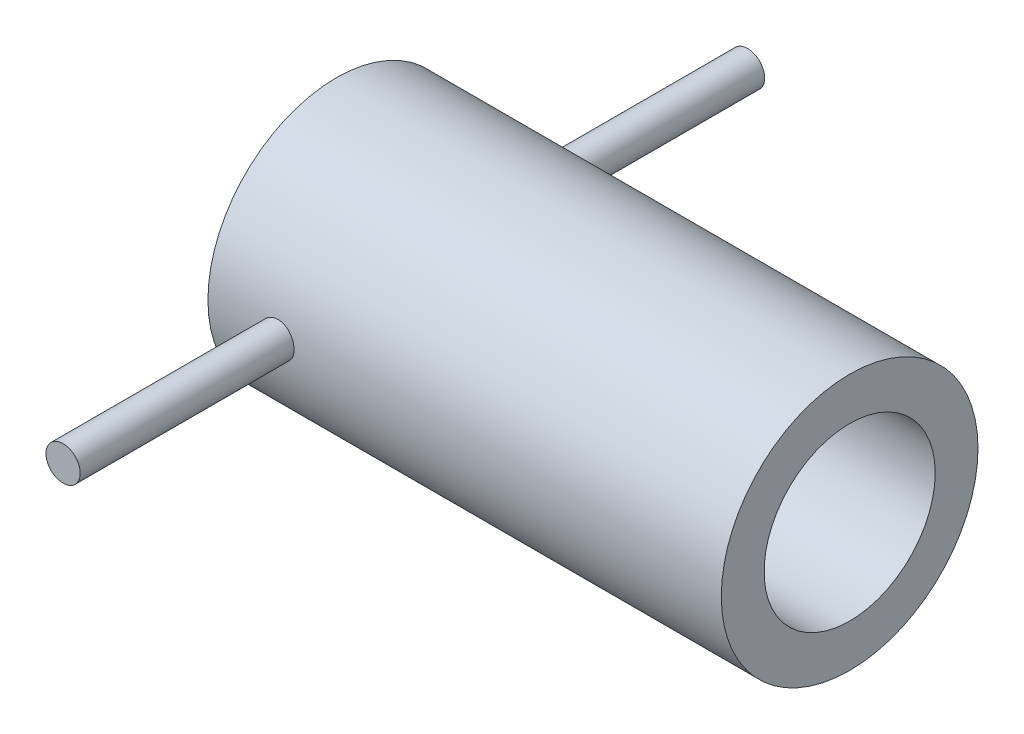
ISO-10303-21;
HEADER;
FILE_DESCRIPTION(('STEP AP214'),'2;1');
FILE_NAME('part.step','',(''),(''),'','','');
FILE_SCHEMA(('AUTOMOTIVE_DESIGN { 1 0 10303 214 1 1 1 1 }'));
ENDSEC;
DATA;
#1=APPLICATION_CONTEXT('core data for automotive mechanical design processes');
#2=APPLICATION_PROTOCOL_DEFINITION('international standard','automotive_design',2000,#1);
#3=PRODUCT_CONTEXT('',#1,'mechanical');
#4=PRODUCT('Part','Part','',(#3));
#5=PRODUCT_RELATED_PRODUCT_CATEGORY('part','',(#4));
#6=PRODUCT_DEFINITION_FORMATION('','',#4);
#7=PRODUCT_DEFINITION_CONTEXT('part definition',#1,'design');
#8=PRODUCT_DEFINITION('design','',#6,#7);
#9=PRODUCT_DEFINITION_SHAPE('','',#8);
#10=(LENGTH_UNIT() NAMED_UNIT(*) SI_UNIT(.MILLI.,.METRE.));
#11=(NAMED_UNIT(*) PLANE_ANGLE_UNIT() SI_UNIT($,.RADIAN.));
#12=(NAMED_UNIT(*) SI_UNIT($,.STERADIAN.) SOLID_ANGLE_UNIT());
#13=UNCERTAINTY_MEASURE_WITH_UNIT(LENGTH_MEASURE(1.E-05),#10,'distance_accuracy_value','');
#14=(GEOMETRIC_REPRESENTATION_CONTEXT(3) GLOBAL_UNCERTAINTY_ASSIGNED_CONTEXT((#13)) GLOBAL_UNIT_ASSIGNED_CONTEXT((#10,
#11,#12)) REPRESENTATION_CONTEXT('',''));
#15=CARTESIAN_POINT('',(0.,0.,0.));
#16=DIRECTION('',(0.,0.,1.));
#17=DIRECTION('',(1.,0.,0.));
#18=AXIS2_PLACEMENT_3D('',#15,#16,#17);
#19=CARTESIAN_POINT('',(75.,0.,0.));
#20=DIRECTION('',(-1.,0.,0.));
#21=DIRECTION('',(0.,0.,1.));
#22=AXIS2_PLACEMENT_3D('',#19,#20,#21);
#23=CYLINDRICAL_SURFACE('',#22,37.5);
#24=CARTESIAN_POINT('',(-59.8253763890586,0.,-37.5));
#25=CARTESIAN_POINT('',(-59.8253780855427,0.139809857161942,-37.5000006035784));
#26=CARTESIAN_POINT('',(-59.81951030376,0.279595172641455,-37.4992166043786));
#27=CARTESIAN_POINT('',(-59.7960848284001,0.558209611683407,-37.4961038038827));
#28=CARTESIAN_POINT('',(-59.778524544305,0.697038516461322,-37.4937746602546));
#29=CARTESIAN_POINT('',(-59.7318243180088,0.972801317522205,-37.4876339352639));
#30=CARTESIAN_POINT('',(-59.7026759867847,1.10973376640755,-37.483821279974));
#31=CARTESIAN_POINT('',(-59.6330048687352,1.38068148762459,-37.4748195285748));
#32=CARTESIAN_POINT('',(-59.5924779143082,1.51469567167939,-37.4696299281757));
#33=CARTESIAN_POINT('',(-59.5004025014623,1.77866517944389,-37.4580270104952));
#34=CARTESIAN_POINT('',(-59.4488659338554,1.90862471015347,-37.4516150142465));
#35=CARTESIAN_POINT('',(-59.3350990543321,2.16377442653378,-37.4377404728693));
#36=CARTESIAN_POINT('',(-59.2728648034437,2.28896283462189,-37.4302775409614));
#37=CARTESIAN_POINT('',(-59.1381982231833,2.53358466180885,-37.4145154352324));
#38=CARTESIAN_POINT('',(-59.0657714029162,2.65302114333451,-37.4062167138416));
#39=CARTESIAN_POINT('',(-58.9111774994236,2.88543153803738,-37.3890073442537));
#40=CARTESIAN_POINT('',(-58.8290068073941,2.99840303368927,-37.3800964698529));
#41=CARTESIAN_POINT('',(-58.6550689952917,3.21762873248845,-37.3618659704914));
#42=CARTESIAN_POINT('',(-58.5632542009023,3.32384495567241,-37.3525444611663));
#43=CARTESIAN_POINT('',(-58.3709906006462,3.52821633618742,-37.3337946917017));
#44=CARTESIAN_POINT('',(-58.2705386135595,3.62636849713842,-37.3243663933498));
#45=CARTESIAN_POINT('',(-58.0617609808159,3.81385543391411,-37.3056749300062));
#46=CARTESIAN_POINT('',(-57.9534378227993,3.90319297468565,-37.2964117139836));
#47=CARTESIAN_POINT('',(-57.7295999978208,4.07249114449239,-37.2783056025132));
#48=CARTESIAN_POINT('',(-57.614082692702,4.15244830229266,-37.2694628633792));
#49=CARTESIAN_POINT('',(-57.3762791708371,4.30264336164983,-37.2524226807134));
#50=CARTESIAN_POINT('',(-57.2539707234856,4.37284634478347,-37.2442275986426));
#51=CARTESIAN_POINT('',(-57.0037723026957,4.50271791105838,-37.2287497766659));
#52=CARTESIAN_POINT('',(-56.8758802733217,4.56238257237183,-37.2214673767056));
#53=CARTESIAN_POINT('',(-56.615501998439,4.67068653301889,-37.208032386443));
#54=CARTESIAN_POINT('',(-56.4830176289613,4.71933027474225,-37.2018793411033));
#55=CARTESIAN_POINT('',(-56.214352836822,4.80527579014028,-37.1908748711901));
#56=CARTESIAN_POINT('',(-56.078171078063,4.84257340269532,-37.1860239242294));
#57=CARTESIAN_POINT('',(-55.6672706014474,4.93656175023382,-37.1737079392625));
#58=CARTESIAN_POINT('',(-55.388344326483,4.97611579552634,-37.1683811858736));
#59=CARTESIAN_POINT('',(-54.8279184182253,5.00788132323698,-37.1641137387289));
#60=CARTESIAN_POINT('',(-54.5464189028065,5.00009496347088,-37.1651727539045));
#61=CARTESIAN_POINT('',(-53.9905848492375,4.93768985074461,-37.1735145714914));
#62=CARTESIAN_POINT('',(-53.7162155885692,4.88337642057535,-37.1807567970259));
#63=CARTESIAN_POINT('',(-53.1805312728646,4.72991913360118,-37.2005886378971));
#64=CARTESIAN_POINT('',(-52.9192165156212,4.63077425464098,-37.2131783751565));
#65=CARTESIAN_POINT('',(-52.4161031163829,4.39014795461964,-37.2423315766249));
#66=CARTESIAN_POINT('',(-52.1743681792701,4.24853487441532,-37.2589073661903));
#67=CARTESIAN_POINT('',(-51.7179784660558,3.92708490703945,-37.2941558924048));
#68=CARTESIAN_POINT('',(-51.5033250989929,3.74724603230753,-37.3128287380671));
#69=CARTESIAN_POINT('',(-51.1054189167464,3.35276223075557,-37.3503474843885));
#70=CARTESIAN_POINT('',(-50.9224267981445,3.13785426223237,-37.3691935894807));
#71=CARTESIAN_POINT('',(-50.5950712608959,2.68023543066727,-37.4047980945058));
#72=CARTESIAN_POINT('',(-50.4507079535257,2.43752448753738,-37.4215564884248));
#73=CARTESIAN_POINT('',(-50.2047035990476,1.93098054789412,-37.4511098438437));
#74=CARTESIAN_POINT('',(-50.103080062495,1.66713894671184,-37.4639031802894));
#75=CARTESIAN_POINT('',(-49.9456530905756,1.12592731123183,-37.4840706475363));
#76=CARTESIAN_POINT('',(-49.889847212477,0.848557998988531,-37.4914450672404));
#77=CARTESIAN_POINT('',(-49.8259803071141,0.290417258182222,-37.4999060344292));
#78=CARTESIAN_POINT('',(-49.8175603834969,0.00968758622736323,-37.5010398461927));
#79=CARTESIAN_POINT('',(-49.8477555504795,-0.549179042906563,-37.4970197884964));
#80=CARTESIAN_POINT('',(-49.8863694979097,-0.827316062935106,-37.4918660718566));
#81=CARTESIAN_POINT('',(-50.0092380181399,-1.37203428935979,-37.4758793838114));
#82=CARTESIAN_POINT('',(-50.0933202934772,-1.63865504284749,-37.4650678570428));
#83=CARTESIAN_POINT('',(-50.3045588202888,-2.15401274541647,-37.4389752318875));
#84=CARTESIAN_POINT('',(-50.4317167152638,-2.40274901169671,-37.4236939629659));
#85=CARTESIAN_POINT('',(-50.7263567164882,-2.87687220241664,-37.3902459322604));
#86=CARTESIAN_POINT('',(-50.8940695730889,-3.10211455798003,-37.3720628686903));
#87=CARTESIAN_POINT('',(-51.2647349423827,-3.52138234549022,-37.3348932252024));
#88=CARTESIAN_POINT('',(-51.4676890548901,-3.71540635947636,-37.3159066088361));
#89=CARTESIAN_POINT('',(-51.9046583805254,-4.06801381819453,-37.2791225338362));
#90=CARTESIAN_POINT('',(-52.138867067389,-4.22635849949014,-37.261333614562));
#91=CARTESIAN_POINT('',(-52.6307781532036,-4.50145846771057,-37.2291034298635));
#92=CARTESIAN_POINT('',(-52.8884800273674,-4.61821468334676,-37.214662089687));
#93=CARTESIAN_POINT('',(-53.4192574410455,-4.80644706354516,-37.190819904382));
#94=CARTESIAN_POINT('',(-53.692285679926,-4.87805501107639,-37.1814044018274));
#95=CARTESIAN_POINT('',(-54.2467803891371,-4.97436238892194,-37.168645171367));
#96=CARTESIAN_POINT('',(-54.5282464072973,-4.99906432832375,-37.1653011186886));
#97=CARTESIAN_POINT('',(-54.9491572552039,-5.00042688871785,-37.1651127634092));
#98=CARTESIAN_POINT('',(-55.0887662631303,-4.99501216960198,-37.165843851816));
#99=CARTESIAN_POINT('',(-55.3670121370874,-4.97253184958062,-37.1688591219892));
#100=CARTESIAN_POINT('',(-55.5056493462869,-4.95547059498608,-37.1711427243797));
#101=CARTESIAN_POINT('',(-55.7810187650848,-4.90981100429211,-37.1772010305187));
#102=CARTESIAN_POINT('',(-55.917750265346,-4.88120848504186,-37.1809762749051));
#103=CARTESIAN_POINT('',(-56.1882528678672,-4.81269401595573,-37.1899068333592));
#104=CARTESIAN_POINT('',(-56.3220250258732,-4.77278617180068,-37.1950616463805));
#105=CARTESIAN_POINT('',(-56.5857021898963,-4.68195430652271,-37.2066042119064));
#106=CARTESIAN_POINT('',(-56.7156076355615,-4.63103154328915,-37.212991823618));
#107=CARTESIAN_POINT('',(-56.9706174837253,-4.51855658876871,-37.2268163237538));
#108=CARTESIAN_POINT('',(-57.095723604845,-4.45700824672088,-37.234252832025));
#109=CARTESIAN_POINT('',(-57.3403661692461,-4.32368363022056,-37.2499699958554));
#110=CARTESIAN_POINT('',(-57.4599005238749,-4.25190356053779,-37.2582509643222));
#111=CARTESIAN_POINT('',(-57.6924875774842,-4.09866580761582,-37.2754192205796));
#112=CARTESIAN_POINT('',(-57.8055425772534,-4.01721159158497,-37.2843062906605));
#113=CARTESIAN_POINT('',(-58.0253182522293,-3.8444845167971,-37.3025138234236));
#114=CARTESIAN_POINT('',(-58.1319812566622,-3.75313857242222,-37.3118371759042));
#115=CARTESIAN_POINT('',(-58.3372069370575,-3.56184184352334,-37.330584150837));
#116=CARTESIAN_POINT('',(-58.4357725281541,-3.46189418245563,-37.3400077358127));
#117=CARTESIAN_POINT('',(-58.6242181917146,-3.25399690729603,-37.3586991263206));
#118=CARTESIAN_POINT('',(-58.7140929971152,-3.14604250986812,-37.367966834608));
#119=CARTESIAN_POINT('',(-58.884427994354,-2.92297556799255,-37.3860766652253));
#120=CARTESIAN_POINT('',(-58.9648916516619,-2.80786568247648,-37.394918943501));
#121=CARTESIAN_POINT('',(-59.1162289761381,-2.57069345067363,-37.4119731315671));
#122=CARTESIAN_POINT('',(-59.1870557480659,-2.44860094515717,-37.4201818802072));
#123=CARTESIAN_POINT('',(-59.318133104004,-2.19886737795079,-37.4356865483206));
#124=CARTESIAN_POINT('',(-59.3783875704174,-2.07122837464114,-37.4429828025999));
#125=CARTESIAN_POINT('',(-59.4878689700669,-1.81135973412983,-37.4564531746304));
#126=CARTESIAN_POINT('',(-59.5371043400181,-1.67913369918061,-37.462628150195));
#127=CARTESIAN_POINT('',(-59.6242289145159,-1.41098911378824,-37.473685750318));
#128=CARTESIAN_POINT('',(-59.6621207528868,-1.27507142850612,-37.4785686748438));
#129=CARTESIAN_POINT('',(-59.7377175167096,-0.951549337616044,-37.4883875197009));
#130=CARTESIAN_POINT('',(-59.7705548715535,-0.762768081383291,-37.4927236192826));
#131=CARTESIAN_POINT('',(-59.8143830507456,-0.382642552902596,-37.4985294338594));
#132=CARTESIAN_POINT('',(-59.8253740678022,-0.191298303278013,-37.4999991741389));
#133=CARTESIAN_POINT('',(-59.8253763890586,0.,-37.5));
#134=B_SPLINE_CURVE_WITH_KNOTS('',3,(#24,#25,#26,#27,#28,#29,#30,#31,#32,#33,#34,#35,#36,#37,
#38,#39,#40,#41,#42,#43,#44,#45,#46,#47,#48,#49,#50,#51,#52,#53,#54,#55,#56,#57,#58,#59,#60,#61,
#62,#63,#64,#65,#66,#67,#68,#69,#70,#71,#72,#73,#74,#75,#76,#77,#78,#79,#80,#81,#82,#83,#84,#85,
#86,#87,#88,#89,#90,#91,#92,#93,#94,#95,#96,#97,#98,#99,#100,#101,#102,#103,#104,#105,#106,#107,
#108,#109,#110,#111,#112,#113,#114,#115,#116,#117,#118,#119,#120,#121,#122,#123,#124,#125,#126,
#127,#128,#129,#130,#131,#132,#133),.UNSPECIFIED.,.T.,.F.,(4,2,2,2,2,2,2,2,2,2,2,2,2,2,2,2,2,2,
2,2,2,2,2,2,2,2,2,2,2,2,2,2,2,2,2,2,2,2,2,2,2,2,2,2,2,2,2,2,2,2,2,2,2,2,4),(0.,
0.419262120559973,0.838617161143731,1.25827634305797,1.67808943278332,2.09745137984392,
2.51696807136684,2.93625887795984,3.35570546372761,3.77733292157985,4.19911634246741,
4.62076703599579,5.04257327353929,5.46585261350652,5.88928914614608,6.31255469213692,
6.73597528141105,7.57687073511491,8.41772786037894,9.25310896470702,10.0885091166522,
10.9265264157034,11.7645872983509,12.6092504493772,13.4539160335633,14.2989273423194,
15.1438935970495,15.9824514620575,16.8209889461179,17.6563709221675,18.4917847748446,
19.332068706503,20.172390793725,21.0181794506422,21.8639492190821,22.7072387056423,
23.5504830818468,23.9692230560843,24.3878068482621,24.8065424933169,25.2251262634093,
25.6436622569952,26.0620469480099,26.480587235261,26.8989779680289,27.3207035244164,
27.7422765847367,28.1641035594343,28.5857747123536,29.0094295472959,29.4329284789613,
29.85610204303,30.2791772752092,30.8528481265814,31.4265139175346),.UNSPECIFIED.);
#135=CARTESIAN_POINT('',(-59.8253763890586,0.,-37.5));
#136=VERTEX_POINT('',#135);
#137=EDGE_CURVE('E43',#136,#136,#134,.T.);
#138=ORIENTED_EDGE('',*,*,#137,.F.);
#139=EDGE_LOOP('',(#138));
#140=FACE_BOUND('',#139,.T.);
#141=CARTESIAN_POINT('',(75.,0.,0.));
#142=DIRECTION('',(1.,0.,0.));
#143=DIRECTION('',(0.,0.,-1.));
#144=AXIS2_PLACEMENT_3D('',#141,#142,#143);
#145=CIRCLE('',#144,37.5);
#146=CARTESIAN_POINT('',(75.,0.,-37.5));
#147=VERTEX_POINT('',#146);
#148=EDGE_CURVE('E48',#147,#147,#145,.T.);
#149=ORIENTED_EDGE('',*,*,#148,.F.);
#150=EDGE_LOOP('',(#149));
#151=FACE_BOUND('',#150,.T.);
#152=CARTESIAN_POINT('',(-75.,0.,0.));
#153=DIRECTION('',(1.,0.,0.));
#154=DIRECTION('',(0.,0.,-1.));
#155=AXIS2_PLACEMENT_3D('',#152,#153,#154);
#156=CIRCLE('',#155,37.5);
#157=CARTESIAN_POINT('',(-75.,0.,-37.5));
#158=VERTEX_POINT('',#157);
#159=EDGE_CURVE('E80',#158,#158,#156,.T.);
#160=ORIENTED_EDGE('',*,*,#159,.T.);
#161=EDGE_LOOP('',(#160));
#162=FACE_BOUND('',#161,.T.);
#163=CARTESIAN_POINT('',(-49.8253763890586,0.,37.5));
#164=CARTESIAN_POINT('',(-49.8253746925745,0.139809857161942,37.5000006035784));
#165=CARTESIAN_POINT('',(-49.8312424743572,0.279595172641456,37.4992166043786));
#166=CARTESIAN_POINT('',(-49.8546679497171,0.558209611683408,37.4961038038827));
#167=CARTESIAN_POINT('',(-49.8722282338122,0.697038516461323,37.4937746602546));
#168=CARTESIAN_POINT('',(-49.9189284601084,0.972801317522205,37.4876339352639));
#169=CARTESIAN_POINT('',(-49.9480767913325,1.10973376640755,37.483821279974));
#170=CARTESIAN_POINT('',(-50.017747909382,1.38068148762459,37.4748195285748));
#171=CARTESIAN_POINT('',(-50.058274863809,1.51469567167939,37.4696299281757));
#172=CARTESIAN_POINT('',(-50.1503502766549,1.77866517944389,37.4580270104952));
#173=CARTESIAN_POINT('',(-50.2018868442618,1.90862471015347,37.4516150142465));
#174=CARTESIAN_POINT('',(-50.3156537237851,2.16377442653378,37.4377404728693));
#175=CARTESIAN_POINT('',(-50.3778879746735,2.28896283462189,37.4302775409614));
#176=CARTESIAN_POINT('',(-50.5125545549339,2.53358466180885,37.4145154352324));
#177=CARTESIAN_POINT('',(-50.584981375201,2.6530211433345,37.4062167138416));
#178=CARTESIAN_POINT('',(-50.7395752786936,2.88543153803738,37.3890073442537));
#179=CARTESIAN_POINT('',(-50.8217459707231,2.99840303368927,37.3800964698529));
#180=CARTESIAN_POINT('',(-50.9956837828255,3.21762873248845,37.3618659704914));
#181=CARTESIAN_POINT('',(-51.0874985772149,3.32384495567241,37.3525444611663));
#182=CARTESIAN_POINT('',(-51.279762177471,3.52821633618742,37.3337946917017));
#183=CARTESIAN_POINT('',(-51.3802141645576,3.62636849713842,37.3243663933498));
#184=CARTESIAN_POINT('',(-51.5889917973013,3.81385543391411,37.3056749300062));
#185=CARTESIAN_POINT('',(-51.6973149553179,3.90319297468566,37.2964117139836));
#186=CARTESIAN_POINT('',(-51.9211527802964,4.07249114449239,37.2783056025132));
#187=CARTESIAN_POINT('',(-52.0366700854153,4.15244830229266,37.2694628633792));
#188=CARTESIAN_POINT('',(-52.2744736072801,4.30264336164983,37.2524226807134));
#189=CARTESIAN_POINT('',(-52.3967820546316,4.37284634478347,37.2442275986426));
#190=CARTESIAN_POINT('',(-52.6469804754215,4.50271791105838,37.2287497766659));
#191=CARTESIAN_POINT('',(-52.7748725047955,4.56238257237183,37.2214673767056));
#192=CARTESIAN_POINT('',(-53.0352507796782,4.67068653301889,37.208032386443));
#193=CARTESIAN_POINT('',(-53.1677351491559,4.71933027474225,37.2018793411033));
#194=CARTESIAN_POINT('',(-53.4363999412952,4.80527579014028,37.1908748711901));
#195=CARTESIAN_POINT('',(-53.5725817000542,4.84257340269532,37.1860239242294));
#196=CARTESIAN_POINT('',(-53.9834821766698,4.93656175023382,37.1737079392625));
#197=CARTESIAN_POINT('',(-54.2624084516342,4.97611579552634,37.1683811858736));
#198=CARTESIAN_POINT('',(-54.8228343598919,5.00788132323698,37.1641137387289));
#199=CARTESIAN_POINT('',(-55.1043338753107,5.00009496347088,37.1651727539045));
#200=CARTESIAN_POINT('',(-55.6601679288797,4.93768985074461,37.1735145714914));
#201=CARTESIAN_POINT('',(-55.934537189548,4.88337642057535,37.1807567970259));
#202=CARTESIAN_POINT('',(-56.4702215052526,4.72991913360118,37.2005886378971));
#203=CARTESIAN_POINT('',(-56.731536262496,4.63077425464098,37.2131783751565));
#204=CARTESIAN_POINT('',(-57.2346496617343,4.39014795461964,37.2423315766249));
#205=CARTESIAN_POINT('',(-57.4763845988471,4.24853487441532,37.2589073661903));
#206=CARTESIAN_POINT('',(-57.9327743120614,3.92708490703946,37.2941558924048));
#207=CARTESIAN_POINT('',(-58.1474276791243,3.74724603230753,37.3128287380671));
#208=CARTESIAN_POINT('',(-58.5453338613708,3.35276223075558,37.3503474843885));
#209=CARTESIAN_POINT('',(-58.7283259799727,3.13785426223237,37.3691935894807));
#210=CARTESIAN_POINT('',(-59.0556815172213,2.68023543066727,37.4047980945058));
#211=CARTESIAN_POINT('',(-59.2000448245915,2.43752448753738,37.4215564884248));
#212=CARTESIAN_POINT('',(-59.4460491790696,1.93098054789413,37.4511098438437));
#213=CARTESIAN_POINT('',(-59.5476727156222,1.66713894671185,37.4639031802894));
#214=CARTESIAN_POINT('',(-59.7050996875416,1.12592731123183,37.4840706475363));
#215=CARTESIAN_POINT('',(-59.7609055656402,0.848557998988532,37.4914450672404));
#216=CARTESIAN_POINT('',(-59.8247724710032,0.290417258182223,37.4999060344292));
#217=CARTESIAN_POINT('',(-59.8331923946203,0.00968758622736388,37.5010398461927));
#218=CARTESIAN_POINT('',(-59.8029972276377,-0.549179042906562,37.4970197884964));
#219=CARTESIAN_POINT('',(-59.7643832802075,-0.827316062935106,37.4918660718566));
#220=CARTESIAN_POINT('',(-59.6415147599773,-1.37203428935979,37.4758793838114));
#221=CARTESIAN_POINT('',(-59.55743248464,-1.63865504284749,37.4650678570428));
#222=CARTESIAN_POINT('',(-59.3461939578284,-2.15401274541646,37.4389752318875));
#223=CARTESIAN_POINT('',(-59.2190360628534,-2.40274901169671,37.4236939629659));
#224=CARTESIAN_POINT('',(-58.924396061629,-2.87687220241664,37.3902459322604));
#225=CARTESIAN_POINT('',(-58.7566832050283,-3.10211455798003,37.3720628686903));
#226=CARTESIAN_POINT('',(-58.3860178357345,-3.52138234549022,37.3348932252024));
#227=CARTESIAN_POINT('',(-58.1830637232271,-3.71540635947636,37.3159066088361));
#228=CARTESIAN_POINT('',(-57.7460943975918,-4.06801381819453,37.2791225338362));
#229=CARTESIAN_POINT('',(-57.5118857107283,-4.22635849949014,37.261333614562));
#230=CARTESIAN_POINT('',(-57.0199746249136,-4.50145846771057,37.2291034298635));
#231=CARTESIAN_POINT('',(-56.7622727507498,-4.61821468334676,37.214662089687));
#232=CARTESIAN_POINT('',(-56.2314953370717,-4.80644706354516,37.190819904382));
#233=CARTESIAN_POINT('',(-55.9584670981912,-4.87805501107639,37.1814044018274));
#234=CARTESIAN_POINT('',(-55.4039723889801,-4.97436238892194,37.168645171367));
#235=CARTESIAN_POINT('',(-55.1225063708199,-4.99906432832375,37.1653011186886));
#236=CARTESIAN_POINT('',(-54.7015955229133,-5.00042688871785,37.1651127634092));
#237=CARTESIAN_POINT('',(-54.5619865149869,-4.99501216960198,37.165843851816));
#238=CARTESIAN_POINT('',(-54.2837406410298,-4.97253184958062,37.1688591219892));
#239=CARTESIAN_POINT('',(-54.1451034318303,-4.95547059498608,37.1711427243797));
#240=CARTESIAN_POINT('',(-53.8697340130324,-4.90981100429211,37.1772010305187));
#241=CARTESIAN_POINT('',(-53.7330025127712,-4.88120848504186,37.1809762749051));
#242=CARTESIAN_POINT('',(-53.46249991025,-4.81269401595573,37.1899068333592));
#243=CARTESIAN_POINT('',(-53.328727752244,-4.77278617180068,37.1950616463805));
#244=CARTESIAN_POINT('',(-53.0650505882209,-4.68195430652271,37.2066042119064));
#245=CARTESIAN_POINT('',(-52.9351451425557,-4.63103154328915,37.212991823618));
#246=CARTESIAN_POINT('',(-52.6801352943919,-4.51855658876871,37.2268163237538));
#247=CARTESIAN_POINT('',(-52.5550291732722,-4.45700824672088,37.234252832025));
#248=CARTESIAN_POINT('',(-52.3103866088711,-4.32368363022056,37.2499699958554));
#249=CARTESIAN_POINT('',(-52.1908522542422,-4.2519035605378,37.2582509643222));
#250=CARTESIAN_POINT('',(-51.958265200633,-4.09866580761583,37.2754192205796));
#251=CARTESIAN_POINT('',(-51.8452102008638,-4.01721159158497,37.2843062906605));
#252=CARTESIAN_POINT('',(-51.6254345258879,-3.84448451679711,37.3025138234236));
#253=CARTESIAN_POINT('',(-51.518771521455,-3.75313857242222,37.3118371759041));
#254=CARTESIAN_POINT('',(-51.3135458410597,-3.56184184352335,37.330584150837));
#255=CARTESIAN_POINT('',(-51.2149802499631,-3.46189418245564,37.3400077358127));
#256=CARTESIAN_POINT('',(-51.0265345864026,-3.25399690729603,37.3586991263206));
#257=CARTESIAN_POINT('',(-50.936659781002,-3.14604250986812,37.367966834608));
#258=CARTESIAN_POINT('',(-50.7663247837632,-2.92297556799255,37.3860766652253));
#259=CARTESIAN_POINT('',(-50.6858611264553,-2.80786568247648,37.394918943501));
#260=CARTESIAN_POINT('',(-50.5345238019791,-2.57069345067362,37.4119731315671));
#261=CARTESIAN_POINT('',(-50.4636970300513,-2.44860094515717,37.4201818802072));
#262=CARTESIAN_POINT('',(-50.3326196741132,-2.19886737795079,37.4356865483206));
#263=CARTESIAN_POINT('',(-50.2723652076998,-2.07122837464113,37.4429828025999));
#264=CARTESIAN_POINT('',(-50.1628838080503,-1.81135973412983,37.4564531746305));
#265=CARTESIAN_POINT('',(-50.1136484380991,-1.67913369918061,37.462628150195));
#266=CARTESIAN_POINT('',(-50.0265238636013,-1.41098911378824,37.473685750318));
#267=CARTESIAN_POINT('',(-49.9886320252304,-1.27507142850612,37.4785686748438));
#268=CARTESIAN_POINT('',(-49.9130352614076,-0.951549337616044,37.4883875197009));
#269=CARTESIAN_POINT('',(-49.8801979065637,-0.762768081383291,37.4927236192826));
#270=CARTESIAN_POINT('',(-49.8363697273715,-0.382642552902596,37.4985294338594));
#271=CARTESIAN_POINT('',(-49.825378710315,-0.191298303278013,37.4999991741389));
#272=CARTESIAN_POINT('',(-49.8253763890586,0.,37.5));
#273=B_SPLINE_CURVE_WITH_KNOTS('',3,(#163,#164,#165,#166,#167,#168,#169,#170,#171,#172,#173,
#174,#175,#176,#177,#178,#179,#180,#181,#182,#183,#184,#185,#186,#187,#188,#189,#190,#191,#192,
#193,#194,#195,#196,#197,#198,#199,#200,#201,#202,#203,#204,#205,#206,#207,#208,#209,#210,#211,
#212,#213,#214,#215,#216,#217,#218,#219,#220,#221,#222,#223,#224,#225,#226,#227,#228,#229,#230,
#231,#232,#233,#234,#235,#236,#237,#238,#239,#240,#241,#242,#243,#244,#245,#246,#247,#248,#249,
#250,#251,#252,#253,#254,#255,#256,#257,#258,#259,#260,#261,#262,#263,#264,#265,#266,#267,#268,
#269,#270,#271,#272),.UNSPECIFIED.,.T.,.F.,(4,2,2,2,2,2,2,2,2,2,2,2,2,2,2,2,2,2,2,2,2,2,2,2,2,2,
2,2,2,2,2,2,2,2,2,2,2,2,2,2,2,2,2,2,2,2,2,2,2,2,2,2,2,2,4),(0.,0.419262120559974,
0.83861716114373,1.25827634305797,1.67808943278332,2.09745137984391,2.51696807136684,
2.93625887795983,3.35570546372761,3.77733292157985,4.19911634246741,4.6207670359958,
5.04257327353928,5.46585261350652,5.88928914614608,6.31255469213692,6.73597528141105,
7.57687073511491,8.41772786037894,9.25310896470703,10.0885091166522,10.9265264157034,
11.7645872983509,12.6092504493772,13.4539160335633,14.2989273423194,15.1438935970495,
15.9824514620574,16.8209889461179,17.6563709221675,18.4917847748446,19.332068706503,
20.172390793725,21.0181794506422,21.8639492190821,22.7072387056423,23.5504830818468,
23.9692230560844,24.3878068482621,24.8065424933169,25.2251262634093,25.6436622569952,
26.0620469480099,26.480587235261,26.8989779680289,27.3207035244164,27.7422765847367,
28.1641035594343,28.5857747123536,29.0094295472959,29.4329284789613,29.85610204303,
30.2791772752092,30.8528481265814,31.4265139175346),.UNSPECIFIED.);
#274=CARTESIAN_POINT('',(-49.8253763890586,0.,37.5));
#275=VERTEX_POINT('',#274);
#276=EDGE_CURVE('E10',#275,#275,#273,.T.);
#277=ORIENTED_EDGE('',*,*,#276,.F.);
#278=EDGE_LOOP('',(#277));
#279=FACE_BOUND('',#278,.T.);
#280=ADVANCED_FACE('F31',(#140,#151,#162,#279),#23,.T.);
#281=CARTESIAN_POINT('',(75.,0.,0.));
#282=DIRECTION('',(-1.,0.,0.));
#283=DIRECTION('',(0.,0.,1.));
#284=AXIS2_PLACEMENT_3D('',#281,#282,#283);
#285=CYLINDRICAL_SURFACE('',#284,25.);
#286=CARTESIAN_POINT('',(-59.8253763890586,0.,-25.));
#287=CARTESIAN_POINT('',(-59.8253791585049,0.138987493787324,-25.0000014065203));
#288=CARTESIAN_POINT('',(-59.8195796383397,0.277940302046087,-24.9988389427216));
#289=CARTESIAN_POINT('',(-59.796432740356,0.554886864496204,-24.994224565157));
#290=CARTESIAN_POINT('',(-59.7790831839561,0.692880432791919,-24.9907722194715));
#291=CARTESIAN_POINT('',(-59.7329578267708,0.966937148503881,-24.981670242636));
#292=CARTESIAN_POINT('',(-59.7041762345727,1.10299928122357,-24.9760194978176));
#293=CARTESIAN_POINT('',(-59.6354017381676,1.37221108352448,-24.9626762565998));
#294=CARTESIAN_POINT('',(-59.5954047128363,1.50535966309261,-24.9549830097359));
#295=CARTESIAN_POINT('',(-59.5045726413168,1.76758319373794,-24.9377804442932));
#296=CARTESIAN_POINT('',(-59.4537522188434,1.896663374225,-24.9282735779222));
#297=CARTESIAN_POINT('',(-59.3416004068709,2.15009997814348,-24.9076944208426));
#298=CARTESIAN_POINT('',(-59.2802651413998,2.2744546389337,-24.8966215531404));
#299=CARTESIAN_POINT('',(-59.1475709583492,2.51749782000809,-24.8732206370355));
#300=CARTESIAN_POINT('',(-59.0762165307647,2.63618884664852,-24.8608931515555));
#301=CARTESIAN_POINT('',(-58.9239367538108,2.86722020463685,-24.8353088041128));
#302=CARTESIAN_POINT('',(-58.8430078315233,2.97955814193968,-24.8220515959613));
#303=CARTESIAN_POINT('',(-58.6711475822288,3.1983785388143,-24.7948114657324));
#304=CARTESIAN_POINT('',(-58.5801097457044,3.30477652475172,-24.780821838943));
#305=CARTESIAN_POINT('',(-58.3894140570231,3.50958996762925,-24.7526457290753));
#306=CARTESIAN_POINT('',(-58.2897530231405,3.60800245195942,-24.738459174971));
#307=CARTESIAN_POINT('',(-58.0825419531325,3.7961092760484,-24.7102933832022));
#308=CARTESIAN_POINT('',(-57.9749942002952,3.88580612172819,-24.6963140869323));
#309=CARTESIAN_POINT('',(-57.752669223601,4.05592901668139,-24.6689453876667));
#310=CARTESIAN_POINT('',(-57.6378893478941,4.13635163435981,-24.6555562041458));
#311=CARTESIAN_POINT('',(-57.400860545909,4.28798741229219,-24.6296394657581));
#312=CARTESIAN_POINT('',(-57.2785550440709,4.35911381454495,-24.6171204770982));
#313=CARTESIAN_POINT('',(-57.0282476419351,4.49081269831453,-24.5934353082732));
#314=CARTESIAN_POINT('',(-56.900243627071,4.55138122040544,-24.5822696361062));
#315=CARTESIAN_POINT('',(-56.5091180329158,4.71644727257975,-24.5513304070068));
#316=CARTESIAN_POINT('',(-56.2385957136642,4.8044888260482,-24.5340820165952));
#317=CARTESIAN_POINT('',(-55.6899149542647,4.9326478026569,-24.508635793463));
#318=CARTESIAN_POINT('',(-55.4119030593517,4.97337819482264,-24.5003223072134));
#319=CARTESIAN_POINT('',(-54.8528378901826,5.00775493418215,-24.4933199482487));
#320=CARTESIAN_POINT('',(-54.571784929849,5.00140609582257,-24.4946300913956));
#321=CARTESIAN_POINT('',(-54.0191396691301,4.94227436036826,-24.5066272442008));
#322=CARTESIAN_POINT('',(-53.7474686158844,4.89019310186595,-24.5171725589932));
#323=CARTESIAN_POINT('',(-53.2167967508168,4.74218902244969,-24.546227391949));
#324=CARTESIAN_POINT('',(-52.9577965447387,4.64626410780486,-24.5647372904543));
#325=CARTESIAN_POINT('',(-52.4577998789118,4.41262402680006,-24.6077809023025));
#326=CARTESIAN_POINT('',(-52.2169369371511,4.27463078523214,-24.632354484594));
#327=CARTESIAN_POINT('',(-51.7615221932624,3.96096784378848,-24.684730944745));
#328=CARTESIAN_POINT('',(-51.5469734194116,3.78529381392921,-24.7125341935642));
#329=CARTESIAN_POINT('',(-51.1462293619023,3.39749968079915,-24.7688510603976));
#330=CARTESIAN_POINT('',(-50.9606135457721,3.18478080820446,-24.797368460096));
#331=CARTESIAN_POINT('',(-50.6276071615434,2.73092511816778,-24.8514424361697));
#332=CARTESIAN_POINT('',(-50.4802170836826,2.48978793632426,-24.8769989745701));
#333=CARTESIAN_POINT('',(-50.2277388418351,1.98529693496818,-24.9223345079227));
#334=CARTESIAN_POINT('',(-50.1227169204615,1.72190909807365,-24.9421044423773));
#335=CARTESIAN_POINT('',(-49.9585740192401,1.18074488209619,-24.9735704494292));
#336=CARTESIAN_POINT('',(-49.8994474790944,0.902970250347198,-24.98526750005));
#337=CARTESIAN_POINT('',(-49.82959411969,0.345897028150548,-24.9991335933204));
#338=CARTESIAN_POINT('',(-49.8180742901437,0.0667016415443215,-25.0014587325673));
#339=CARTESIAN_POINT('',(-49.841625684983,-0.489624670880019,-24.9967525965614));
#340=CARTESIAN_POINT('',(-49.8766942902782,-0.766755711869969,-24.9897218472742));
#341=CARTESIAN_POINT('',(-49.9917682523618,-1.30852830007857,-24.9671916002008));
#342=CARTESIAN_POINT('',(-50.071366715153,-1.57325974299468,-24.9517688194687));
#343=CARTESIAN_POINT('',(-50.272796318734,-2.08561813620307,-24.9141776037933));
#344=CARTESIAN_POINT('',(-50.3946306236135,-2.33324380335236,-24.892008663478));
#345=CARTESIAN_POINT('',(-50.6787887803956,-2.80770587332562,-24.8429955738642));
#346=CARTESIAN_POINT('',(-50.8415900618592,-3.03425065213175,-24.8160975113418));
#347=CARTESIAN_POINT('',(-51.2024225775141,-3.45709007722326,-24.760736752006));
#348=CARTESIAN_POINT('',(-51.4004575888513,-3.65338147605435,-24.7322738876682));
#349=CARTESIAN_POINT('',(-51.8297422675063,-4.01320302351496,-24.6764651380018));
#350=CARTESIAN_POINT('',(-52.0614517988535,-4.17618877400404,-24.6491428619003));
#351=CARTESIAN_POINT('',(-52.5494365070213,-4.46092683850573,-24.5992097395686));
#352=CARTESIAN_POINT('',(-52.8057107004412,-4.58268080227279,-24.5765987048474));
#353=CARTESIAN_POINT('',(-53.3342053213124,-4.78076018011429,-24.5388364729789));
#354=CARTESIAN_POINT('',(-53.6063348069157,-4.85732111853824,-24.5236466726876));
#355=CARTESIAN_POINT('',(-54.1600894386431,-4.96353963899985,-24.5023739077135));
#356=CARTESIAN_POINT('',(-54.4417133415807,-4.99320333752649,-24.4962897554484));
#357=CARTESIAN_POINT('',(-54.8620467780137,-5.00179339144585,-24.4945288792509));
#358=CARTESIAN_POINT('',(-55.0006029572078,-4.99885021968411,-24.4951330184965));
#359=CARTESIAN_POINT('',(-55.2769501847731,-4.98148651470878,-24.4986714739674));
#360=CARTESIAN_POINT('',(-55.4147415035338,-4.96707033718489,-24.5016049058833));
#361=CARTESIAN_POINT('',(-55.6886254049777,-4.92686276339315,-24.5097212135577));
#362=CARTESIAN_POINT('',(-55.8247173760274,-4.90106738632088,-24.5149048765081));
#363=CARTESIAN_POINT('',(-56.0941562947983,-4.83831799577184,-24.5273664043086));
#364=CARTESIAN_POINT('',(-56.2275042037426,-4.80136796328245,-24.5346435219816));
#365=CARTESIAN_POINT('',(-56.4902990896251,-4.7166781184435,-24.5510651803018));
#366=CARTESIAN_POINT('',(-56.6197536343597,-4.66896100938054,-24.5602057877658));
#367=CARTESIAN_POINT('',(-56.8741280854638,-4.56306801677477,-24.5800998692381));
#368=CARTESIAN_POINT('',(-56.9990495775137,-4.50489583368539,-24.5908527723703));
#369=CARTESIAN_POINT('',(-57.2436239517857,-4.37847423732261,-24.6136768592635));
#370=CARTESIAN_POINT('',(-57.3632746208306,-4.31022064232976,-24.6257485895239));
#371=CARTESIAN_POINT('',(-57.5964256345532,-4.1641570153785,-24.6508678052533));
#372=CARTESIAN_POINT('',(-57.7099280707611,-4.08635026305033,-24.6639149552593));
#373=CARTESIAN_POINT('',(-57.9320031243573,-3.92025868558202,-24.6908640955351));
#374=CARTESIAN_POINT('',(-58.0404559287658,-3.83181538764856,-24.7047769949563));
#375=CARTESIAN_POINT('',(-58.2495146854156,-3.64620484015059,-24.7328525343466));
#376=CARTESIAN_POINT('',(-58.3501233807127,-3.54904066604526,-24.7470150848702));
#377=CARTESIAN_POINT('',(-58.5429170098616,-3.34655721556743,-24.7752095204235));
#378=CARTESIAN_POINT('',(-58.6350969208347,-3.24123314471885,-24.7892413231228));
#379=CARTESIAN_POINT('',(-58.8103033290853,-3.02322778921367,-24.8167717117019));
#380=CARTESIAN_POINT('',(-58.8933331823056,-2.91054922625043,-24.8302704919035));
#381=CARTESIAN_POINT('',(-59.0505502861737,-2.67729343786964,-24.8565085935593));
#382=CARTESIAN_POINT('',(-59.1246316201184,-2.55664367436166,-24.869238066002));
#383=CARTESIAN_POINT('',(-59.2623207242753,-2.30944481023433,-24.8934104051449));
#384=CARTESIAN_POINT('',(-59.3259323403722,-2.18289789785573,-24.9048537437938));
#385=CARTESIAN_POINT('',(-59.4422008925589,-1.9248233263731,-24.9261268452452));
#386=CARTESIAN_POINT('',(-59.4948644593591,-1.79329873940674,-24.9359575839567));
#387=CARTESIAN_POINT('',(-59.5888640697716,-1.5261844247676,-24.9537310452209));
#388=CARTESIAN_POINT('',(-59.6302022956795,-1.39059548585458,-24.9616741314688));
#389=CARTESIAN_POINT('',(-59.718599516256,-1.04920215690347,-24.9788087281562));
#390=CARTESIAN_POINT('',(-59.7585861997741,-0.841457494405875,-24.9867141903289));
#391=CARTESIAN_POINT('',(-59.8119721084774,-0.422448453280688,-24.9973086745575));
#392=CARTESIAN_POINT('',(-59.8253721810305,-0.211184187046263,-24.9999978628663));
#393=CARTESIAN_POINT('',(-59.8253763890586,0.,-25.));
#394=B_SPLINE_CURVE_WITH_KNOTS('',3,(#286,#287,#288,#289,#290,#291,#292,#293,#294,#295,#296,
#297,#298,#299,#300,#301,#302,#303,#304,#305,#306,#307,#308,#309,#310,#311,#312,#313,#314,#315,
#316,#317,#318,#319,#320,#321,#322,#323,#324,#325,#326,#327,#328,#329,#330,#331,#332,#333,#334,
#335,#336,#337,#338,#339,#340,#341,#342,#343,#344,#345,#346,#347,#348,#349,#350,#351,#352,#353,
#354,#355,#356,#357,#358,#359,#360,#361,#362,#363,#364,#365,#366,#367,#368,#369,#370,#371,#372,
#373,#374,#375,#376,#377,#378,#379,#380,#381,#382,#383,#384,#385,#386,#387,#388,#389,#390,#391,
#392,#393),.UNSPECIFIED.,.T.,.F.,(4,2,2,2,2,2,2,2,2,2,2,2,2,2,2,2,2,2,2,2,2,2,2,2,2,2,2,2,2,2,2,
2,2,2,2,2,2,2,2,2,2,2,2,2,2,2,2,2,2,2,2,2,2,4),(0.,0.416777047445418,0.833632730149863,
1.25069985977206,1.66792044248879,2.08458084615619,2.50139517036217,2.91802329572165,
3.33480738770838,3.75649664408719,4.17834216132242,4.6000660283689,5.02194544187044,
5.44751701120413,5.8732478370127,6.72369555497643,7.56299734191928,8.40221330082506,
9.22877443707772,10.0553750494503,10.8875625969434,11.7198458242473,12.5671007113313,
13.4143664637548,14.262951829465,15.1114343716656,15.9457248705771,16.7799684696572,
17.6067107843,18.4335150475649,19.2704413884317,20.1074575040603,20.9572195157251,
21.8069475229371,22.652207138419,23.4973565033242,23.9127168808878,24.3279196434016,
24.7432677723233,25.1584678424529,25.5728004765726,25.9869867501795,26.4013453111813,
26.8155620171985,27.2369706991647,27.6582313488923,28.0797414220244,28.5010963808509,
28.9270309561325,29.3528087202144,29.7783278548953,30.203764937947,30.8370559265657,
31.4703267306208),.UNSPECIFIED.);
#395=CARTESIAN_POINT('',(-59.8253763890586,0.,-25.));
#396=VERTEX_POINT('',#395);
#397=EDGE_CURVE('E73',#396,#396,#394,.T.);
#398=ORIENTED_EDGE('',*,*,#397,.T.);
#399=EDGE_LOOP('',(#398));
#400=FACE_BOUND('',#399,.T.);
#401=CARTESIAN_POINT('',(75.,0.,0.));
#402=DIRECTION('',(1.,0.,0.));
#403=DIRECTION('',(0.,0.,-1.));
#404=AXIS2_PLACEMENT_3D('',#401,#402,#403);
#405=CIRCLE('',#404,25.);
#406=CARTESIAN_POINT('',(75.,0.,-25.));
#407=VERTEX_POINT('',#406);
#408=EDGE_CURVE('E56',#407,#407,#405,.T.);
#409=ORIENTED_EDGE('',*,*,#408,.T.);
#410=EDGE_LOOP('',(#409));
#411=FACE_BOUND('',#410,.T.);
#412=CARTESIAN_POINT('',(-75.,0.,0.));
#413=DIRECTION('',(1.,0.,0.));
#414=DIRECTION('',(0.,0.,-1.));
#415=AXIS2_PLACEMENT_3D('',#412,#413,#414);
#416=CIRCLE('',#415,25.);
#417=CARTESIAN_POINT('',(-75.,0.,-25.));
#418=VERTEX_POINT('',#417);
#419=EDGE_CURVE('E84',#418,#418,#416,.T.);
#420=ORIENTED_EDGE('',*,*,#419,.F.);
#421=EDGE_LOOP('',(#420));
#422=FACE_BOUND('',#421,.T.);
#423=CARTESIAN_POINT('',(-49.8253763890586,0.,25.));
#424=CARTESIAN_POINT('',(-49.8253736196123,0.138987493787325,25.0000014065203));
#425=CARTESIAN_POINT('',(-49.8311731397775,0.277940302046089,24.9988389427216));
#426=CARTESIAN_POINT('',(-49.8543200377612,0.554886864496206,24.994224565157));
#427=CARTESIAN_POINT('',(-49.8716695941611,0.69288043279192,24.9907722194715));
#428=CARTESIAN_POINT('',(-49.9177949513464,0.966937148503882,24.981670242636));
#429=CARTESIAN_POINT('',(-49.9465765435445,1.10299928122357,24.9760194978176));
#430=CARTESIAN_POINT('',(-50.0153510399496,1.37221108352448,24.9626762565998));
#431=CARTESIAN_POINT('',(-50.0553480652809,1.50535966309261,24.9549830097359));
#432=CARTESIAN_POINT('',(-50.1461801368004,1.76758319373794,24.9377804442932));
#433=CARTESIAN_POINT('',(-50.1970005592738,1.896663374225,24.9282735779222));
#434=CARTESIAN_POINT('',(-50.3091523712463,2.15009997814348,24.9076944208426));
#435=CARTESIAN_POINT('',(-50.3704876367174,2.2744546389337,24.8966215531404));
#436=CARTESIAN_POINT('',(-50.503181819768,2.51749782000809,24.8732206370355));
#437=CARTESIAN_POINT('',(-50.5745362473525,2.63618884664851,24.8608931515555));
#438=CARTESIAN_POINT('',(-50.7268160243064,2.86722020463685,24.8353088041128));
#439=CARTESIAN_POINT('',(-50.8077449465939,2.97955814193968,24.8220515959613));
#440=CARTESIAN_POINT('',(-50.9796051958884,3.19837853881429,24.7948114657324));
#441=CARTESIAN_POINT('',(-51.0706430324128,3.30477652475172,24.780821838943));
#442=CARTESIAN_POINT('',(-51.2613387210941,3.50958996762925,24.7526457290753));
#443=CARTESIAN_POINT('',(-51.3609997549767,3.60800245195942,24.738459174971));
#444=CARTESIAN_POINT('',(-51.5682108249847,3.79610927604841,24.7102933832022));
#445=CARTESIAN_POINT('',(-51.675758577822,3.88580612172819,24.6963140869323));
#446=CARTESIAN_POINT('',(-51.8980835545162,4.05592901668139,24.6689453876667));
#447=CARTESIAN_POINT('',(-52.0128634302231,4.13635163435981,24.6555562041458));
#448=CARTESIAN_POINT('',(-52.2498922322081,4.28798741229219,24.6296394657581));
#449=CARTESIAN_POINT('',(-52.3721977340463,4.35911381454494,24.6171204770982));
#450=CARTESIAN_POINT('',(-52.6225051361821,4.49081269831453,24.5934353082732));
#451=CARTESIAN_POINT('',(-52.7505091510462,4.55138122040543,24.5822696361062));
#452=CARTESIAN_POINT('',(-53.1416347452014,4.71644727257975,24.5513304070068));
#453=CARTESIAN_POINT('',(-53.412157064453,4.8044888260482,24.5340820165952));
#454=CARTESIAN_POINT('',(-53.9608378238525,4.93264780265691,24.508635793463));
#455=CARTESIAN_POINT('',(-54.2388497187655,4.97337819482264,24.5003223072134));
#456=CARTESIAN_POINT('',(-54.7979148879346,5.00775493418215,24.4933199482487));
#457=CARTESIAN_POINT('',(-55.0789678482682,5.00140609582257,24.4946300913956));
#458=CARTESIAN_POINT('',(-55.6316131089871,4.94227436036826,24.5066272442008));
#459=CARTESIAN_POINT('',(-55.9032841622329,4.89019310186595,24.5171725589932));
#460=CARTESIAN_POINT('',(-56.4339560273003,4.74218902244969,24.546227391949));
#461=CARTESIAN_POINT('',(-56.6929562333785,4.64626410780486,24.5647372904543));
#462=CARTESIAN_POINT('',(-57.1929528992054,4.41262402680007,24.6077809023025));
#463=CARTESIAN_POINT('',(-57.4338158409661,4.27463078523214,24.632354484594));
#464=CARTESIAN_POINT('',(-57.8892305848548,3.96096784378848,24.684730944745));
#465=CARTESIAN_POINT('',(-58.1037793587056,3.78529381392921,24.7125341935642));
#466=CARTESIAN_POINT('',(-58.5045234162149,3.39749968079915,24.7688510603976));
#467=CARTESIAN_POINT('',(-58.6901392323451,3.18478080820446,24.797368460096));
#468=CARTESIAN_POINT('',(-59.0231456165738,2.73092511816778,24.8514424361697));
#469=CARTESIAN_POINT('',(-59.1705356944346,2.48978793632426,24.8769989745701));
#470=CARTESIAN_POINT('',(-59.4230139362821,1.98529693496818,24.9223345079227));
#471=CARTESIAN_POINT('',(-59.5280358576557,1.72190909807365,24.9421044423773));
#472=CARTESIAN_POINT('',(-59.6921787588771,1.18074488209619,24.9735704494292));
#473=CARTESIAN_POINT('',(-59.7513052990228,0.902970250347198,24.98526750005));
#474=CARTESIAN_POINT('',(-59.8211586584272,0.345897028150547,24.9991335933204));
#475=CARTESIAN_POINT('',(-59.8326784879735,0.0667016415443211,25.0014587325673));
#476=CARTESIAN_POINT('',(-59.8091270931342,-0.48962467088002,24.9967525965614));
#477=CARTESIAN_POINT('',(-59.774058487839,-0.766755711869969,24.9897218472742));
#478=CARTESIAN_POINT('',(-59.6589845257554,-1.30852830007857,24.9671916002008));
#479=CARTESIAN_POINT('',(-59.5793860629642,-1.57325974299469,24.9517688194687));
#480=CARTESIAN_POINT('',(-59.3779564593832,-2.08561813620307,24.9141776037933));
#481=CARTESIAN_POINT('',(-59.2561221545037,-2.33324380335236,24.892008663478));
#482=CARTESIAN_POINT('',(-58.9719639977216,-2.80770587332562,24.8429955738642));
#483=CARTESIAN_POINT('',(-58.809162716258,-3.03425065213174,24.8160975113418));
#484=CARTESIAN_POINT('',(-58.4483302006031,-3.45709007722326,24.760736752006));
#485=CARTESIAN_POINT('',(-58.2502951892659,-3.65338147605435,24.7322738876682));
#486=CARTESIAN_POINT('',(-57.8210105106109,-4.01320302351496,24.6764651380018));
#487=CARTESIAN_POINT('',(-57.5893009792637,-4.17618877400404,24.6491428619003));
#488=CARTESIAN_POINT('',(-57.1013162710959,-4.46092683850573,24.5992097395686));
#489=CARTESIAN_POINT('',(-56.845042077676,-4.58268080227279,24.5765987048474));
#490=CARTESIAN_POINT('',(-56.3165474568048,-4.78076018011429,24.5388364729789));
#491=CARTESIAN_POINT('',(-56.0444179712015,-4.85732111853824,24.5236466726876));
#492=CARTESIAN_POINT('',(-55.4906633394741,-4.96353963899985,24.5023739077135));
#493=CARTESIAN_POINT('',(-55.2090394365365,-4.99320333752649,24.4962897554484));
#494=CARTESIAN_POINT('',(-54.7887060001035,-5.00179339144585,24.4945288792509));
#495=CARTESIAN_POINT('',(-54.6501498209093,-4.99885021968411,24.4951330184965));
#496=CARTESIAN_POINT('',(-54.3738025933441,-4.98148651470878,24.4986714739674));
#497=CARTESIAN_POINT('',(-54.2360112745834,-4.9670703371849,24.5016049058833));
#498=CARTESIAN_POINT('',(-53.9621273731395,-4.92686276339316,24.5097212135577));
#499=CARTESIAN_POINT('',(-53.8260354020899,-4.90106738632089,24.5149048765081));
#500=CARTESIAN_POINT('',(-53.5565964833189,-4.83831799577184,24.5273664043086));
#501=CARTESIAN_POINT('',(-53.4232485743746,-4.80136796328245,24.5346435219816));
#502=CARTESIAN_POINT('',(-53.1604536884921,-4.7166781184435,24.5510651803018));
#503=CARTESIAN_POINT('',(-53.0309991437575,-4.66896100938054,24.5602057877658));
#504=CARTESIAN_POINT('',(-52.7766246926534,-4.56306801677477,24.5800998692381));
#505=CARTESIAN_POINT('',(-52.6517032006035,-4.50489583368539,24.5908527723703));
#506=CARTESIAN_POINT('',(-52.4071288263315,-4.37847423732261,24.6136768592635));
#507=CARTESIAN_POINT('',(-52.2874781572866,-4.31022064232976,24.6257485895239));
#508=CARTESIAN_POINT('',(-52.054327143564,-4.1641570153785,24.6508678052533));
#509=CARTESIAN_POINT('',(-51.9408247073561,-4.08635026305033,24.6639149552593));
#510=CARTESIAN_POINT('',(-51.7187496537599,-3.92025868558202,24.6908640955351));
#511=CARTESIAN_POINT('',(-51.6102968493514,-3.83181538764856,24.7047769949563));
#512=CARTESIAN_POINT('',(-51.4012380927016,-3.64620484015059,24.7328525343466));
#513=CARTESIAN_POINT('',(-51.3006293974045,-3.54904066604526,24.7470150848702));
#514=CARTESIAN_POINT('',(-51.1078357682556,-3.34655721556743,24.7752095204235));
#515=CARTESIAN_POINT('',(-51.0156558572825,-3.24123314471885,24.7892413231228));
#516=CARTESIAN_POINT('',(-50.8404494490319,-3.02322778921367,24.8167717117019));
#517=CARTESIAN_POINT('',(-50.7574195958116,-2.91054922625043,24.8302704919035));
#518=CARTESIAN_POINT('',(-50.6002024919435,-2.67729343786964,24.8565085935593));
#519=CARTESIAN_POINT('',(-50.5261211579988,-2.55664367436166,24.869238066002));
#520=CARTESIAN_POINT('',(-50.3884320538419,-2.30944481023433,24.8934104051449));
#521=CARTESIAN_POINT('',(-50.324820437745,-2.18289789785573,24.9048537437938));
#522=CARTESIAN_POINT('',(-50.2085518855583,-1.9248233263731,24.9261268452451));
#523=CARTESIAN_POINT('',(-50.1558883187581,-1.79329873940675,24.9359575839567));
#524=CARTESIAN_POINT('',(-50.0618887083456,-1.5261844247676,24.9537310452209));
#525=CARTESIAN_POINT('',(-50.0205504824377,-1.39059548585458,24.9616741314688));
#526=CARTESIAN_POINT('',(-49.9321532618612,-1.04920215690347,24.9788087281562));
#527=CARTESIAN_POINT('',(-49.8921665783431,-0.841457494405877,24.9867141903289));
#528=CARTESIAN_POINT('',(-49.8387806696398,-0.42244845328069,24.9973086745575));
#529=CARTESIAN_POINT('',(-49.8253805970867,-0.211184187046264,24.9999978628663));
#530=CARTESIAN_POINT('',(-49.8253763890586,0.,25.));
#531=B_SPLINE_CURVE_WITH_KNOTS('',3,(#423,#424,#425,#426,#427,#428,#429,#430,#431,#432,#433,
#434,#435,#436,#437,#438,#439,#440,#441,#442,#443,#444,#445,#446,#447,#448,#449,#450,#451,#452,
#453,#454,#455,#456,#457,#458,#459,#460,#461,#462,#463,#464,#465,#466,#467,#468,#469,#470,#471,
#472,#473,#474,#475,#476,#477,#478,#479,#480,#481,#482,#483,#484,#485,#486,#487,#488,#489,#490,
#491,#492,#493,#494,#495,#496,#497,#498,#499,#500,#501,#502,#503,#504,#505,#506,#507,#508,#509,
#510,#511,#512,#513,#514,#515,#516,#517,#518,#519,#520,#521,#522,#523,#524,#525,#526,#527,#528,
#529,#530),.UNSPECIFIED.,.T.,.F.,(4,2,2,2,2,2,2,2,2,2,2,2,2,2,2,2,2,2,2,2,2,2,2,2,2,2,2,2,2,2,2,
2,2,2,2,2,2,2,2,2,2,2,2,2,2,2,2,2,2,2,2,2,2,4),(0.,0.416777047445419,0.833632730149864,
1.25069985977206,1.66792044248879,2.08458084615619,2.50139517036217,2.91802329572164,
3.33480738770838,3.75649664408719,4.17834216132243,4.6000660283689,5.02194544187044,
5.44751701120412,5.87324783701269,6.72369555497643,7.56299734191929,8.40221330082506,
9.22877443707772,10.0553750494503,10.8875625969434,11.7198458242473,12.5671007113313,
13.4143664637548,14.262951829465,15.1114343716656,15.9457248705771,16.7799684696572,
17.6067107843,18.4335150475649,19.2704413884317,20.1074575040603,20.9572195157251,
21.8069475229371,22.652207138419,23.4973565033242,23.9127168808878,24.3279196434016,
24.7432677723233,25.1584678424529,25.5728004765726,25.9869867501795,26.4013453111813,
26.8155620171985,27.2369706991647,27.6582313488923,28.0797414220244,28.5010963808509,
28.9270309561325,29.3528087202143,29.7783278548953,30.203764937947,30.8370559265657,
31.4703267306208),.UNSPECIFIED.);
#532=CARTESIAN_POINT('',(-49.8253763890586,0.,25.));
#533=VERTEX_POINT('',#532);
#534=EDGE_CURVE('E35',#533,#533,#531,.T.);
#535=ORIENTED_EDGE('',*,*,#534,.T.);
#536=EDGE_LOOP('',(#535));
#537=FACE_BOUND('',#536,.T.);
#538=ADVANCED_FACE('F68',(#400,#411,#422,#537),#285,.F.);
#539=CARTESIAN_POINT('',(75.,0.,0.));
#540=DIRECTION('',(1.,0.,0.));
#541=DIRECTION('',(0.,0.,-1.));
#542=AXIS2_PLACEMENT_3D('',#539,#540,#541);
#543=PLANE('',#542);
#544=ORIENTED_EDGE('',*,*,#148,.T.);
#545=EDGE_LOOP('',(#544));
#546=FACE_BOUND('',#545,.T.);
#547=ORIENTED_EDGE('',*,*,#408,.F.);
#548=EDGE_LOOP('',(#547));
#549=FACE_BOUND('',#548,.T.);
#550=ADVANCED_FACE('F97',(#546,#549),#543,.T.);
#551=CARTESIAN_POINT('',(-75.,0.,0.));
#552=DIRECTION('',(1.,0.,0.));
#553=DIRECTION('',(0.,0.,-1.));
#554=AXIS2_PLACEMENT_3D('',#551,#552,#553);
#555=PLANE('',#554);
#556=ORIENTED_EDGE('',*,*,#159,.F.);
#557=EDGE_LOOP('',(#556));
#558=FACE_BOUND('',#557,.T.);
#559=ORIENTED_EDGE('',*,*,#419,.T.);
#560=EDGE_LOOP('',(#559));
#561=FACE_BOUND('',#560,.T.);
#562=ADVANCED_FACE('F63',(#558,#561),#555,.F.);
#563=CARTESIAN_POINT('',(-54.8253763890586,0.,100.));
#564=DIRECTION('',(0.,0.,-1.));
#565=DIRECTION('',(-1.,0.,0.));
#566=AXIS2_PLACEMENT_3D('',#563,#564,#565);
#567=CYLINDRICAL_SURFACE('',#566,5.);
#568=ORIENTED_EDGE('',*,*,#534,.F.);
#569=EDGE_LOOP('',(#568));
#570=FACE_BOUND('',#569,.T.);
#571=ORIENTED_EDGE('',*,*,#397,.F.);
#572=EDGE_LOOP('',(#571));
#573=FACE_BOUND('',#572,.T.);
#574=ADVANCED_FACE('F58',(#570,#573),#567,.T.);
#575=CARTESIAN_POINT('',(-54.8253763890586,0.,-100.));
#576=DIRECTION('',(0.,0.,1.));
#577=DIRECTION('',(1.,0.,0.));
#578=AXIS2_PLACEMENT_3D('',#575,#576,#577);
#579=PLANE('',#578);
#580=CARTESIAN_POINT('',(-54.8253763890586,0.,-100.));
#581=DIRECTION('',(0.,0.,1.));
#582=DIRECTION('',(1.,0.,0.));
#583=AXIS2_PLACEMENT_3D('',#580,#581,#582);
#584=CIRCLE('',#583,5.);
#585=CARTESIAN_POINT('',(-49.8253763890586,0.,-100.));
#586=VERTEX_POINT('',#585);
#587=EDGE_CURVE('E129',#586,#586,#584,.T.);
#588=ORIENTED_EDGE('',*,*,#587,.F.);
#589=EDGE_LOOP('',(#588));
#590=FACE_BOUND('',#589,.T.);
#591=ADVANCED_FACE('F62',(#590),#579,.F.);
#592=ORIENTED_EDGE('',*,*,#587,.T.);
#593=EDGE_LOOP('',(#592));
#594=FACE_BOUND('',#593,.T.);
#595=ORIENTED_EDGE('',*,*,#137,.T.);
#596=EDGE_LOOP('',(#595));
#597=FACE_BOUND('',#596,.T.);
#598=ADVANCED_FACE('F66',(#594,#597),#567,.T.);
#599=CARTESIAN_POINT('',(-54.8253763890586,0.,100.));
#600=DIRECTION('',(0.,0.,1.));
#601=DIRECTION('',(1.,0.,0.));
#602=AXIS2_PLACEMENT_3D('',#599,#600,#601);
#603=CIRCLE('',#602,5.);
#604=CARTESIAN_POINT('',(-49.8253763890586,0.,100.));
#605=VERTEX_POINT('',#604);
#606=EDGE_CURVE('E79',#605,#605,#603,.T.);
#607=ORIENTED_EDGE('',*,*,#606,.F.);
#608=EDGE_LOOP('',(#607));
#609=FACE_BOUND('',#608,.T.);
#610=ORIENTED_EDGE('',*,*,#276,.T.);
#611=EDGE_LOOP('',(#610));
#612=FACE_BOUND('',#611,.T.);
#613=ADVANCED_FACE('F65',(#609,#612),#567,.T.);
#614=CARTESIAN_POINT('',(-54.8253763890586,0.,100.));
#615=DIRECTION('',(0.,0.,1.));
#616=DIRECTION('',(1.,0.,0.));
#617=AXIS2_PLACEMENT_3D('',#614,#615,#616);
#618=PLANE('',#617);
#619=ORIENTED_EDGE('',*,*,#606,.T.);
#620=EDGE_LOOP('',(#619));
#621=FACE_BOUND('',#620,.T.);
#622=ADVANCED_FACE('F124',(#621),#618,.T.);
#623=CLOSED_SHELL('',(#280,#538,#550,#562,#574,#591,#598,#613,#622));
#624=MANIFOLD_SOLID_BREP('B2',#623);
#625=ADVANCED_BREP_SHAPE_REPRESENTATION('',(#18,#624),#14);
#626=SHAPE_DEFINITION_REPRESENTATION(#9,#625);
ENDSEC;
END-ISO-10303-21;
